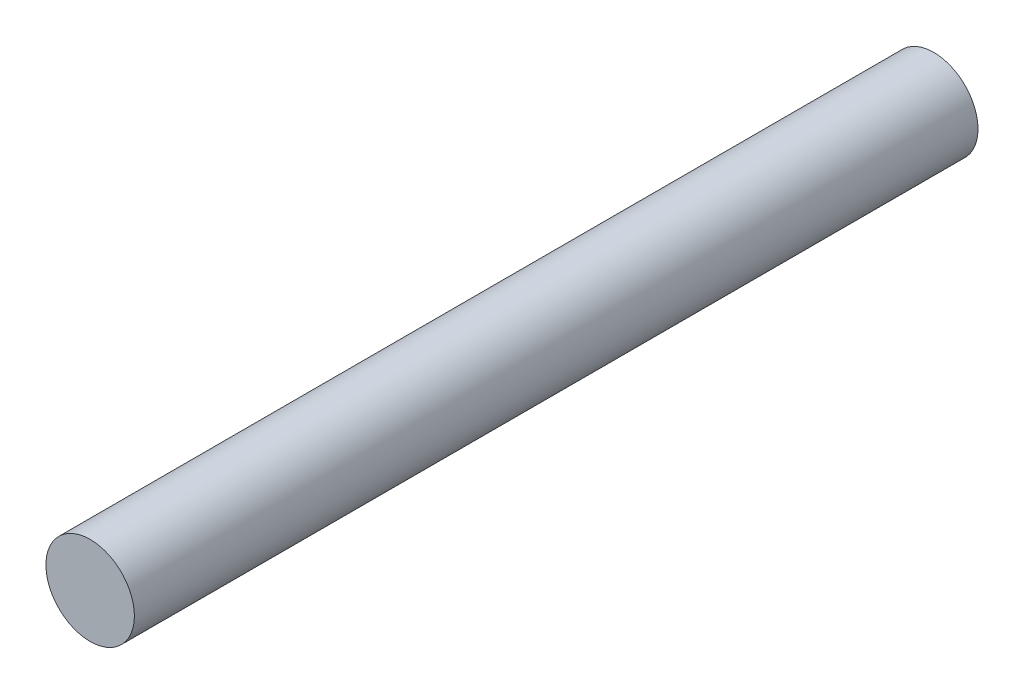
ISO-10303-21;
HEADER;
FILE_DESCRIPTION(('STEP AP214'),'2;1');
FILE_NAME('part.step','',(''),(''),'','','');
FILE_SCHEMA(('AUTOMOTIVE_DESIGN { 1 0 10303 214 1 1 1 1 }'));
ENDSEC;
DATA;
#1=APPLICATION_CONTEXT('core data for automotive mechanical design processes');
#2=APPLICATION_PROTOCOL_DEFINITION('international standard','automotive_design',2000,#1);
#3=PRODUCT_CONTEXT('',#1,'mechanical');
#4=PRODUCT('Part','Part','',(#3));
#5=PRODUCT_RELATED_PRODUCT_CATEGORY('part','',(#4));
#6=PRODUCT_DEFINITION_FORMATION('','',#4);
#7=PRODUCT_DEFINITION_CONTEXT('part definition',#1,'design');
#8=PRODUCT_DEFINITION('design','',#6,#7);
#9=PRODUCT_DEFINITION_SHAPE('','',#8);
#10=(LENGTH_UNIT() NAMED_UNIT(*) SI_UNIT(.MILLI.,.METRE.));
#11=(NAMED_UNIT(*) PLANE_ANGLE_UNIT() SI_UNIT($,.RADIAN.));
#12=(NAMED_UNIT(*) SI_UNIT($,.STERADIAN.) SOLID_ANGLE_UNIT());
#13=UNCERTAINTY_MEASURE_WITH_UNIT(LENGTH_MEASURE(1.E-05),#10,'distance_accuracy_value','');
#14=(GEOMETRIC_REPRESENTATION_CONTEXT(3) GLOBAL_UNCERTAINTY_ASSIGNED_CONTEXT((#13)) GLOBAL_UNIT_ASSIGNED_CONTEXT((#10,
#11,#12)) REPRESENTATION_CONTEXT('',''));
#15=CARTESIAN_POINT('',(0.,0.,0.));
#16=DIRECTION('',(0.,0.,1.));
#17=DIRECTION('',(1.,0.,0.));
#18=AXIS2_PLACEMENT_3D('',#15,#16,#17);
#19=CARTESIAN_POINT('',(0.,0.,35.));
#20=DIRECTION('',(0.,0.,-1.));
#21=DIRECTION('',(-1.,0.,0.));
#22=AXIS2_PLACEMENT_3D('',#19,#20,#21);
#23=PLANE('',#22);
#24=CARTESIAN_POINT('',(0.,0.,35.));
#25=DIRECTION('',(0.,0.,1.));
#26=DIRECTION('',(1.,0.,0.));
#27=AXIS2_PLACEMENT_3D('',#24,#25,#26);
#28=CIRCLE('',#27,3.933);
#29=CARTESIAN_POINT('',(3.933,0.,35.));
#30=VERTEX_POINT('',#29);
#31=EDGE_CURVE('E18',#30,#30,#28,.F.);
#32=ORIENTED_EDGE('',*,*,#31,.F.);
#33=EDGE_LOOP('',(#32));
#34=FACE_BOUND('',#33,.T.);
#35=ADVANCED_FACE('F15',(#34),#23,.F.);
#36=CARTESIAN_POINT('',(0.,0.,-40.));
#37=DIRECTION('',(0.,0.,1.));
#38=DIRECTION('',(1.,0.,0.));
#39=AXIS2_PLACEMENT_3D('',#36,#37,#38);
#40=PLANE('',#39);
#41=CARTESIAN_POINT('',(0.,0.,-40.));
#42=DIRECTION('',(0.,0.,1.));
#43=DIRECTION('',(1.,0.,0.));
#44=AXIS2_PLACEMENT_3D('',#41,#42,#43);
#45=CIRCLE('',#44,3.933);
#46=CARTESIAN_POINT('',(3.933,0.,-40.));
#47=VERTEX_POINT('',#46);
#48=EDGE_CURVE('E10',#47,#47,#45,.T.);
#49=ORIENTED_EDGE('',*,*,#48,.F.);
#50=EDGE_LOOP('',(#49));
#51=FACE_BOUND('',#50,.T.);
#52=ADVANCED_FACE('F30',(#51),#40,.F.);
#53=CARTESIAN_POINT('',(0.,0.,-40.));
#54=DIRECTION('',(0.,0.,1.));
#55=DIRECTION('',(1.,0.,0.));
#56=AXIS2_PLACEMENT_3D('',#53,#54,#55);
#57=CYLINDRICAL_SURFACE('',#56,3.933);
#58=ORIENTED_EDGE('',*,*,#48,.T.);
#59=EDGE_LOOP('',(#58));
#60=FACE_BOUND('',#59,.T.);
#61=ORIENTED_EDGE('',*,*,#31,.T.);
#62=EDGE_LOOP('',(#61));
#63=FACE_BOUND('',#62,.T.);
#64=ADVANCED_FACE('F27',(#60,#63),#57,.T.);
#65=CLOSED_SHELL('',(#35,#52,#64));
#66=MANIFOLD_SOLID_BREP('B1',#65);
#67=ADVANCED_BREP_SHAPE_REPRESENTATION('',(#18,#66),#14);
#68=SHAPE_DEFINITION_REPRESENTATION(#9,#67);
ENDSEC;
END-ISO-10303-21;
